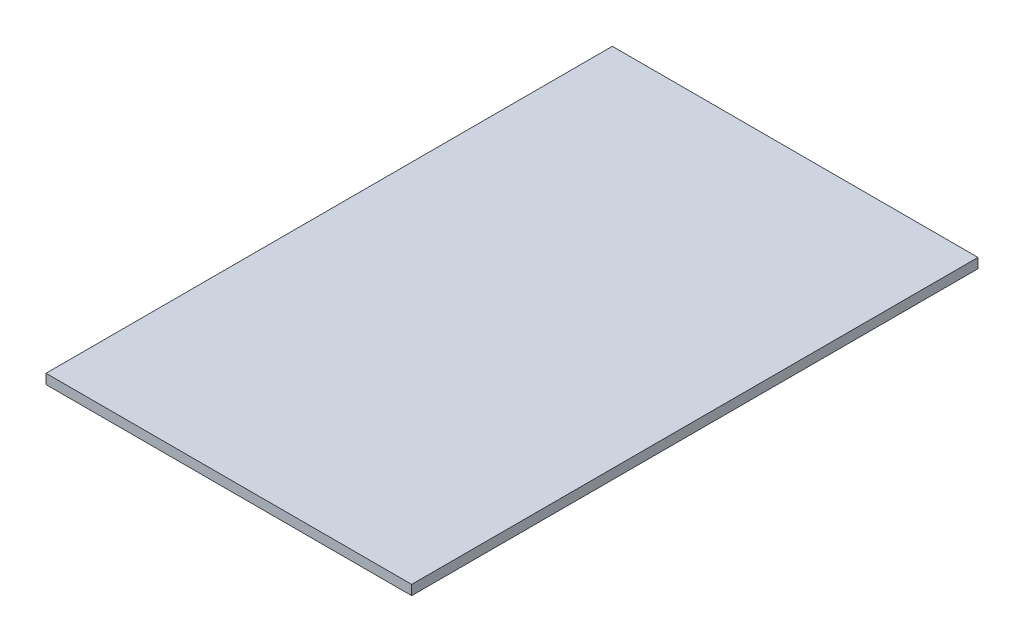
ISO-10303-21;
HEADER;
FILE_DESCRIPTION(('STEP AP214'),'2;1');
FILE_NAME('part.step','',(''),(''),'','','');
FILE_SCHEMA(('AUTOMOTIVE_DESIGN { 1 0 10303 214 1 1 1 1 }'));
ENDSEC;
DATA;
#1=APPLICATION_CONTEXT('core data for automotive mechanical design processes');
#2=APPLICATION_PROTOCOL_DEFINITION('international standard','automotive_design',2000,#1);
#3=PRODUCT_CONTEXT('',#1,'mechanical');
#4=PRODUCT('Part','Part','',(#3));
#5=PRODUCT_RELATED_PRODUCT_CATEGORY('part','',(#4));
#6=PRODUCT_DEFINITION_FORMATION('','',#4);
#7=PRODUCT_DEFINITION_CONTEXT('part definition',#1,'design');
#8=PRODUCT_DEFINITION('design','',#6,#7);
#9=PRODUCT_DEFINITION_SHAPE('','',#8);
#10=(LENGTH_UNIT() NAMED_UNIT(*) SI_UNIT(.MILLI.,.METRE.));
#11=(NAMED_UNIT(*) PLANE_ANGLE_UNIT() SI_UNIT($,.RADIAN.));
#12=(NAMED_UNIT(*) SI_UNIT($,.STERADIAN.) SOLID_ANGLE_UNIT());
#13=UNCERTAINTY_MEASURE_WITH_UNIT(LENGTH_MEASURE(1.E-05),#10,'distance_accuracy_value','');
#14=(GEOMETRIC_REPRESENTATION_CONTEXT(3) GLOBAL_UNCERTAINTY_ASSIGNED_CONTEXT((#13)) GLOBAL_UNIT_ASSIGNED_CONTEXT((#10,
#11,#12)) REPRESENTATION_CONTEXT('',''));
#15=CARTESIAN_POINT('',(0.,0.,0.));
#16=DIRECTION('',(0.,0.,1.));
#17=DIRECTION('',(1.,0.,0.));
#18=AXIS2_PLACEMENT_3D('',#15,#16,#17);
#19=CARTESIAN_POINT('',(20.5,1.1,-31.75));
#20=DIRECTION('',(-1.,0.,0.));
#21=DIRECTION('',(0.,0.,1.));
#22=AXIS2_PLACEMENT_3D('',#19,#20,#21);
#23=PLANE('',#22);
#24=DIRECTION('',(0.,0.,-1.));
#25=VECTOR('',#24,1.);
#26=CARTESIAN_POINT('',(20.5,0.,-31.75));
#27=LINE('',#26,#25);
#28=CARTESIAN_POINT('',(20.5,0.,31.75));
#29=VERTEX_POINT('',#28);
#30=CARTESIAN_POINT('',(20.5,0.,-31.75));
#31=VERTEX_POINT('',#30);
#32=EDGE_CURVE('E96',#29,#31,#27,.T.);
#33=ORIENTED_EDGE('',*,*,#32,.T.);
#34=DIRECTION('',(0.,-1.,0.));
#35=VECTOR('',#34,1.);
#36=CARTESIAN_POINT('',(20.5,1.1,-31.75));
#37=LINE('',#36,#35);
#38=CARTESIAN_POINT('',(20.5,1.1,-31.75));
#39=VERTEX_POINT('',#38);
#40=EDGE_CURVE('E11',#39,#31,#37,.T.);
#41=ORIENTED_EDGE('',*,*,#40,.F.);
#42=DIRECTION('',(0.,0.,-1.));
#43=VECTOR('',#42,1.);
#44=CARTESIAN_POINT('',(20.5,1.1,-31.75));
#45=LINE('',#44,#43);
#46=CARTESIAN_POINT('',(20.5,1.1,31.75));
#47=VERTEX_POINT('',#46);
#48=EDGE_CURVE('E84',#47,#39,#45,.T.);
#49=ORIENTED_EDGE('',*,*,#48,.F.);
#50=DIRECTION('',(0.,-1.,0.));
#51=VECTOR('',#50,1.);
#52=CARTESIAN_POINT('',(20.5,1.1,31.75));
#53=LINE('',#52,#51);
#54=EDGE_CURVE('E92',#47,#29,#53,.T.);
#55=ORIENTED_EDGE('',*,*,#54,.T.);
#56=EDGE_LOOP('',(#33,#41,#49,#55));
#57=FACE_BOUND('',#56,.T.);
#58=ADVANCED_FACE('F33',(#57),#23,.F.);
#59=CARTESIAN_POINT('',(-20.5,1.1,-31.75));
#60=DIRECTION('',(0.,0.,1.));
#61=DIRECTION('',(1.,0.,0.));
#62=AXIS2_PLACEMENT_3D('',#59,#60,#61);
#63=PLANE('',#62);
#64=DIRECTION('',(-1.,0.,0.));
#65=VECTOR('',#64,1.);
#66=CARTESIAN_POINT('',(-20.5,0.,-31.75));
#67=LINE('',#66,#65);
#68=CARTESIAN_POINT('',(-20.5,0.,-31.75));
#69=VERTEX_POINT('',#68);
#70=EDGE_CURVE('E88',#31,#69,#67,.T.);
#71=ORIENTED_EDGE('',*,*,#70,.T.);
#72=DIRECTION('',(0.,-1.,0.));
#73=VECTOR('',#72,1.);
#74=CARTESIAN_POINT('',(-20.5,1.1,-31.75));
#75=LINE('',#74,#73);
#76=CARTESIAN_POINT('',(-20.5,1.1,-31.75));
#77=VERTEX_POINT('',#76);
#78=EDGE_CURVE('E41',#77,#69,#75,.T.);
#79=ORIENTED_EDGE('',*,*,#78,.F.);
#80=DIRECTION('',(-1.,0.,0.));
#81=VECTOR('',#80,1.);
#82=CARTESIAN_POINT('',(-20.5,1.1,-31.75));
#83=LINE('',#82,#81);
#84=EDGE_CURVE('E79',#39,#77,#83,.T.);
#85=ORIENTED_EDGE('',*,*,#84,.F.);
#86=ORIENTED_EDGE('',*,*,#40,.T.);
#87=EDGE_LOOP('',(#71,#79,#85,#86));
#88=FACE_BOUND('',#87,.T.);
#89=ADVANCED_FACE('F87',(#88),#63,.F.);
#90=CARTESIAN_POINT('',(-20.5,1.1,-31.75));
#91=DIRECTION('',(1.,0.,0.));
#92=DIRECTION('',(0.,0.,-1.));
#93=AXIS2_PLACEMENT_3D('',#90,#91,#92);
#94=PLANE('',#93);
#95=DIRECTION('',(0.,0.,1.));
#96=VECTOR('',#95,1.);
#97=CARTESIAN_POINT('',(-20.5,0.,-31.75));
#98=LINE('',#97,#96);
#99=CARTESIAN_POINT('',(-20.5,0.,31.75));
#100=VERTEX_POINT('',#99);
#101=EDGE_CURVE('E66',#69,#100,#98,.T.);
#102=ORIENTED_EDGE('',*,*,#101,.T.);
#103=DIRECTION('',(0.,-1.,0.));
#104=VECTOR('',#103,1.);
#105=CARTESIAN_POINT('',(-20.5,1.1,31.75));
#106=LINE('',#105,#104);
#107=CARTESIAN_POINT('',(-20.5,1.1,31.75));
#108=VERTEX_POINT('',#107);
#109=EDGE_CURVE('E89',#108,#100,#106,.T.);
#110=ORIENTED_EDGE('',*,*,#109,.F.);
#111=DIRECTION('',(0.,0.,1.));
#112=VECTOR('',#111,1.);
#113=CARTESIAN_POINT('',(-20.5,1.1,-31.75));
#114=LINE('',#113,#112);
#115=EDGE_CURVE('E82',#77,#108,#114,.T.);
#116=ORIENTED_EDGE('',*,*,#115,.F.);
#117=ORIENTED_EDGE('',*,*,#78,.T.);
#118=EDGE_LOOP('',(#102,#110,#116,#117));
#119=FACE_BOUND('',#118,.T.);
#120=ADVANCED_FACE('F90',(#119),#94,.F.);
#121=CARTESIAN_POINT('',(-20.5,1.1,31.75));
#122=DIRECTION('',(0.,0.,-1.));
#123=DIRECTION('',(-1.,0.,0.));
#124=AXIS2_PLACEMENT_3D('',#121,#122,#123);
#125=PLANE('',#124);
#126=DIRECTION('',(1.,0.,0.));
#127=VECTOR('',#126,1.);
#128=CARTESIAN_POINT('',(-20.5,0.,31.75));
#129=LINE('',#128,#127);
#130=EDGE_CURVE('E72',#100,#29,#129,.T.);
#131=ORIENTED_EDGE('',*,*,#130,.T.);
#132=ORIENTED_EDGE('',*,*,#54,.F.);
#133=DIRECTION('',(1.,0.,0.));
#134=VECTOR('',#133,1.);
#135=CARTESIAN_POINT('',(-20.5,1.1,31.75));
#136=LINE('',#135,#134);
#137=EDGE_CURVE('E49',#108,#47,#136,.T.);
#138=ORIENTED_EDGE('',*,*,#137,.F.);
#139=ORIENTED_EDGE('',*,*,#109,.T.);
#140=EDGE_LOOP('',(#131,#132,#138,#139));
#141=FACE_BOUND('',#140,.T.);
#142=ADVANCED_FACE('F103',(#141),#125,.F.);
#143=CARTESIAN_POINT('',(0.,1.1,0.));
#144=DIRECTION('',(0.,1.,0.));
#145=DIRECTION('',(0.,0.,1.));
#146=AXIS2_PLACEMENT_3D('',#143,#144,#145);
#147=PLANE('',#146);
#148=ORIENTED_EDGE('',*,*,#48,.T.);
#149=ORIENTED_EDGE('',*,*,#84,.T.);
#150=ORIENTED_EDGE('',*,*,#115,.T.);
#151=ORIENTED_EDGE('',*,*,#137,.T.);
#152=EDGE_LOOP('',(#148,#149,#150,#151));
#153=FACE_BOUND('',#152,.T.);
#154=ADVANCED_FACE('F80',(#153),#147,.T.);
#155=CARTESIAN_POINT('',(0.,0.,0.));
#156=DIRECTION('',(0.,1.,0.));
#157=DIRECTION('',(0.,0.,1.));
#158=AXIS2_PLACEMENT_3D('',#155,#156,#157);
#159=PLANE('',#158);
#160=ORIENTED_EDGE('',*,*,#32,.F.);
#161=ORIENTED_EDGE('',*,*,#130,.F.);
#162=ORIENTED_EDGE('',*,*,#101,.F.);
#163=ORIENTED_EDGE('',*,*,#70,.F.);
#164=EDGE_LOOP('',(#160,#161,#162,#163));
#165=FACE_BOUND('',#164,.T.);
#166=ADVANCED_FACE('F106',(#165),#159,.F.);
#167=CLOSED_SHELL('',(#58,#89,#120,#142,#154,#166));
#168=MANIFOLD_SOLID_BREP('B2',#167);
#169=ADVANCED_BREP_SHAPE_REPRESENTATION('',(#18,#168),#14);
#170=SHAPE_DEFINITION_REPRESENTATION(#9,#169);
ENDSEC;
END-ISO-10303-21;
